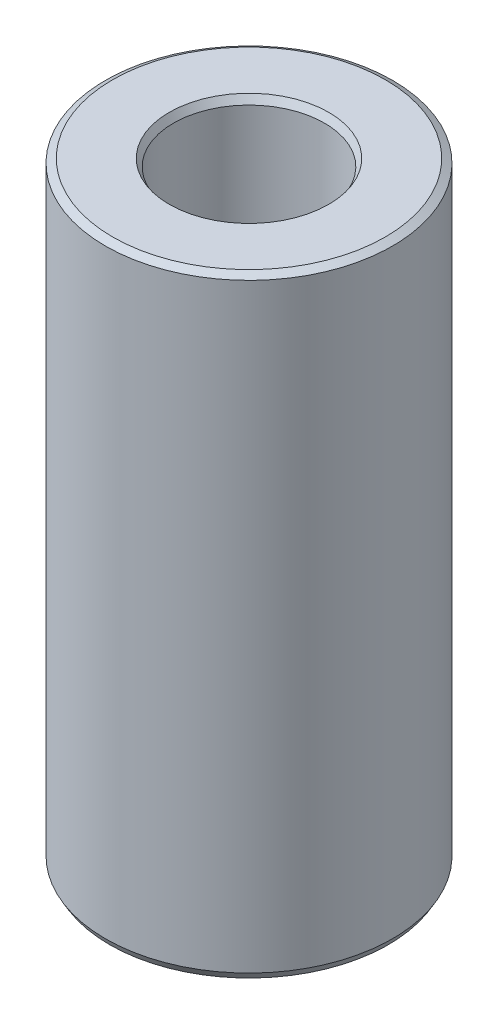
ISO-10303-21;
HEADER;
FILE_DESCRIPTION(('STEP AP214'),'2;1');
FILE_NAME('part.step','',(''),(''),'','','');
FILE_SCHEMA(('AUTOMOTIVE_DESIGN { 1 0 10303 214 1 1 1 1 }'));
ENDSEC;
DATA;
#1=APPLICATION_CONTEXT('core data for automotive mechanical design processes');
#2=APPLICATION_PROTOCOL_DEFINITION('international standard','automotive_design',2000,#1);
#3=PRODUCT_CONTEXT('',#1,'mechanical');
#4=PRODUCT('Part','Part','',(#3));
#5=PRODUCT_RELATED_PRODUCT_CATEGORY('part','',(#4));
#6=PRODUCT_DEFINITION_FORMATION('','',#4);
#7=PRODUCT_DEFINITION_CONTEXT('part definition',#1,'design');
#8=PRODUCT_DEFINITION('design','',#6,#7);
#9=PRODUCT_DEFINITION_SHAPE('','',#8);
#10=(LENGTH_UNIT() NAMED_UNIT(*) SI_UNIT(.MILLI.,.METRE.));
#11=(NAMED_UNIT(*) PLANE_ANGLE_UNIT() SI_UNIT($,.RADIAN.));
#12=(NAMED_UNIT(*) SI_UNIT($,.STERADIAN.) SOLID_ANGLE_UNIT());
#13=UNCERTAINTY_MEASURE_WITH_UNIT(LENGTH_MEASURE(1.E-05),#10,'distance_accuracy_value','');
#14=(GEOMETRIC_REPRESENTATION_CONTEXT(3) GLOBAL_UNCERTAINTY_ASSIGNED_CONTEXT((#13)) GLOBAL_UNIT_ASSIGNED_CONTEXT((#10,
#11,#12)) REPRESENTATION_CONTEXT('',''));
#15=CARTESIAN_POINT('',(0.,0.,0.));
#16=DIRECTION('',(0.,0.,1.));
#17=DIRECTION('',(1.,0.,0.));
#18=AXIS2_PLACEMENT_3D('',#15,#16,#17);
#19=CARTESIAN_POINT('',(0.,149.0547617418,0.));
#20=DIRECTION('',(0.,-1.,0.));
#21=DIRECTION('',(0.,0.,-1.));
#22=AXIS2_PLACEMENT_3D('',#19,#20,#21);
#23=CYLINDRICAL_SURFACE('',#22,35.);
#24=CARTESIAN_POINT('',(0.,1.76960312657348,0.));
#25=DIRECTION('',(0.,1.,0.));
#26=DIRECTION('',(0.,0.,1.));
#27=AXIS2_PLACEMENT_3D('',#24,#25,#26);
#28=CIRCLE('',#27,35.);
#29=CARTESIAN_POINT('',(0.,1.76960312657348,35.));
#30=VERTEX_POINT('',#29);
#31=EDGE_CURVE('E10',#30,#30,#28,.T.);
#32=ORIENTED_EDGE('',*,*,#31,.T.);
#33=EDGE_LOOP('',(#32));
#34=FACE_BOUND('',#33,.T.);
#35=CARTESIAN_POINT('',(0.,148.033080900314,0.));
#36=DIRECTION('',(0.,1.,0.));
#37=DIRECTION('',(0.,0.,1.));
#38=AXIS2_PLACEMENT_3D('',#35,#36,#37);
#39=CIRCLE('',#38,35.);
#40=CARTESIAN_POINT('',(0.,148.033080900314,35.));
#41=VERTEX_POINT('',#40);
#42=EDGE_CURVE('E50',#41,#41,#39,.F.);
#43=ORIENTED_EDGE('',*,*,#42,.T.);
#44=EDGE_LOOP('',(#43));
#45=FACE_BOUND('',#44,.T.);
#46=ADVANCED_FACE('F39',(#34,#45),#23,.T.);
#47=CARTESIAN_POINT('',(0.,149.0547617418,0.));
#48=DIRECTION('',(0.,1.,0.));
#49=DIRECTION('',(0.,0.,1.));
#50=AXIS2_PLACEMENT_3D('',#47,#48,#49);
#51=PLANE('',#50);
#52=CARTESIAN_POINT('',(0.,149.0547617418,0.));
#53=DIRECTION('',(0.,1.,0.));
#54=DIRECTION('',(0.,0.,1.));
#55=AXIS2_PLACEMENT_3D('',#52,#53,#54);
#56=CIRCLE('',#55,19.446078956217);
#57=CARTESIAN_POINT('',(0.,149.0547617418,19.446078956217));
#58=VERTEX_POINT('',#57);
#59=EDGE_CURVE('E58',#58,#58,#56,.F.);
#60=ORIENTED_EDGE('',*,*,#59,.T.);
#61=EDGE_LOOP('',(#60));
#62=FACE_BOUND('',#61,.T.);
#63=CARTESIAN_POINT('',(0.,149.0547617418,0.));
#64=DIRECTION('',(0.,1.,0.));
#65=DIRECTION('',(0.,0.,1.));
#66=AXIS2_PLACEMENT_3D('',#63,#64,#65);
#67=CIRCLE('',#66,33.2303968734266);
#68=CARTESIAN_POINT('',(0.,149.0547617418,33.2303968734266));
#69=VERTEX_POINT('',#68);
#70=EDGE_CURVE('E61',#69,#69,#67,.T.);
#71=ORIENTED_EDGE('',*,*,#70,.T.);
#72=EDGE_LOOP('',(#71));
#73=FACE_BOUND('',#72,.T.);
#74=ADVANCED_FACE('F88',(#62,#73),#51,.T.);
#75=CARTESIAN_POINT('',(0.,0.,0.));
#76=DIRECTION('',(0.,1.,0.));
#77=DIRECTION('',(0.,0.,1.));
#78=AXIS2_PLACEMENT_3D('',#75,#76,#77);
#79=PLANE('',#78);
#80=CARTESIAN_POINT('',(0.,0.,0.));
#81=DIRECTION('',(0.,1.,0.));
#82=DIRECTION('',(0.,0.,1.));
#83=AXIS2_PLACEMENT_3D('',#80,#81,#82);
#84=CIRCLE('',#83,20.1940012413044);
#85=CARTESIAN_POINT('',(0.,0.,20.1940012413044));
#86=VERTEX_POINT('',#85);
#87=EDGE_CURVE('E51',#86,#86,#84,.T.);
#88=ORIENTED_EDGE('',*,*,#87,.T.);
#89=EDGE_LOOP('',(#88));
#90=FACE_BOUND('',#89,.T.);
#91=CARTESIAN_POINT('',(0.,0.,0.));
#92=DIRECTION('',(0.,1.,0.));
#93=DIRECTION('',(0.,0.,1.));
#94=AXIS2_PLACEMENT_3D('',#91,#92,#93);
#95=CIRCLE('',#94,33.978319158514);
#96=CARTESIAN_POINT('',(0.,0.,33.978319158514));
#97=VERTEX_POINT('',#96);
#98=EDGE_CURVE('E54',#97,#97,#95,.F.);
#99=ORIENTED_EDGE('',*,*,#98,.T.);
#100=EDGE_LOOP('',(#99));
#101=FACE_BOUND('',#100,.T.);
#102=ADVANCED_FACE('F83',(#90,#101),#79,.F.);
#103=CARTESIAN_POINT('',(0.,149.0547617418,0.));
#104=DIRECTION('',(0.,-1.,0.));
#105=DIRECTION('',(0.,0.,-1.));
#106=AXIS2_PLACEMENT_3D('',#103,#104,#105);
#107=CYLINDRICAL_SURFACE('',#106,18.424398114731);
#108=CARTESIAN_POINT('',(0.,147.285158615226,0.));
#109=DIRECTION('',(0.,1.,0.));
#110=DIRECTION('',(0.,0.,1.));
#111=AXIS2_PLACEMENT_3D('',#108,#109,#110);
#112=CIRCLE('',#111,18.424398114731);
#113=CARTESIAN_POINT('',(0.,147.285158615226,18.424398114731));
#114=VERTEX_POINT('',#113);
#115=EDGE_CURVE('E67',#114,#114,#112,.T.);
#116=ORIENTED_EDGE('',*,*,#115,.T.);
#117=EDGE_LOOP('',(#116));
#118=FACE_BOUND('',#117,.T.);
#119=CARTESIAN_POINT('',(0.,1.02168084148596,0.));
#120=DIRECTION('',(0.,1.,0.));
#121=DIRECTION('',(0.,0.,1.));
#122=AXIS2_PLACEMENT_3D('',#119,#120,#121);
#123=CIRCLE('',#122,18.424398114731);
#124=CARTESIAN_POINT('',(0.,1.02168084148596,18.424398114731));
#125=VERTEX_POINT('',#124);
#126=EDGE_CURVE('E69',#125,#125,#123,.F.);
#127=ORIENTED_EDGE('',*,*,#126,.T.);
#128=EDGE_LOOP('',(#127));
#129=FACE_BOUND('',#128,.T.);
#130=ADVANCED_FACE('F71',(#118,#129),#107,.F.);
#131=CARTESIAN_POINT('',(0.,147.285158615226,0.));
#132=DIRECTION('',(0.,1.,0.));
#133=DIRECTION('',(0.,0.,1.));
#134=AXIS2_PLACEMENT_3D('',#131,#132,#133);
#135=CONICAL_SURFACE('',#134,18.424398114731,0.523598775598305);
#136=ORIENTED_EDGE('',*,*,#59,.F.);
#137=EDGE_LOOP('',(#136));
#138=FACE_BOUND('',#137,.T.);
#139=ORIENTED_EDGE('',*,*,#115,.F.);
#140=EDGE_LOOP('',(#139));
#141=FACE_BOUND('',#140,.T.);
#142=ADVANCED_FACE('F77',(#138,#141),#135,.F.);
#143=CARTESIAN_POINT('',(0.,0.,0.));
#144=DIRECTION('',(0.,-1.,0.));
#145=DIRECTION('',(0.,0.,-1.));
#146=AXIS2_PLACEMENT_3D('',#143,#144,#145);
#147=CONICAL_SURFACE('',#146,20.1940012413044,1.04719755119659);
#148=ORIENTED_EDGE('',*,*,#126,.F.);
#149=EDGE_LOOP('',(#148));
#150=FACE_BOUND('',#149,.T.);
#151=ORIENTED_EDGE('',*,*,#87,.F.);
#152=EDGE_LOOP('',(#151));
#153=FACE_BOUND('',#152,.T.);
#154=ADVANCED_FACE('F73',(#150,#153),#147,.F.);
#155=CARTESIAN_POINT('',(0.,1.76960312657348,0.));
#156=DIRECTION('',(0.,1.,0.));
#157=DIRECTION('',(0.,0.,1.));
#158=AXIS2_PLACEMENT_3D('',#155,#156,#157);
#159=CONICAL_SURFACE('',#158,35.,0.523598775598299);
#160=ORIENTED_EDGE('',*,*,#98,.F.);
#161=EDGE_LOOP('',(#160));
#162=FACE_BOUND('',#161,.T.);
#163=ORIENTED_EDGE('',*,*,#31,.F.);
#164=EDGE_LOOP('',(#163));
#165=FACE_BOUND('',#164,.T.);
#166=ADVANCED_FACE('F76',(#162,#165),#159,.T.);
#167=CARTESIAN_POINT('',(0.,149.0547617418,0.));
#168=DIRECTION('',(0.,-1.,0.));
#169=DIRECTION('',(0.,0.,-1.));
#170=AXIS2_PLACEMENT_3D('',#167,#168,#169);
#171=CONICAL_SURFACE('',#170,33.2303968734266,1.0471975511966);
#172=ORIENTED_EDGE('',*,*,#42,.F.);
#173=EDGE_LOOP('',(#172));
#174=FACE_BOUND('',#173,.T.);
#175=ORIENTED_EDGE('',*,*,#70,.F.);
#176=EDGE_LOOP('',(#175));
#177=FACE_BOUND('',#176,.T.);
#178=ADVANCED_FACE('F45',(#174,#177),#171,.T.);
#179=CLOSED_SHELL('',(#46,#74,#102,#130,#142,#154,#166,#178));
#180=MANIFOLD_SOLID_BREP('B2',#179);
#181=ADVANCED_BREP_SHAPE_REPRESENTATION('',(#18,#180),#14);
#182=SHAPE_DEFINITION_REPRESENTATION(#9,#181);
ENDSEC;
END-ISO-10303-21;
